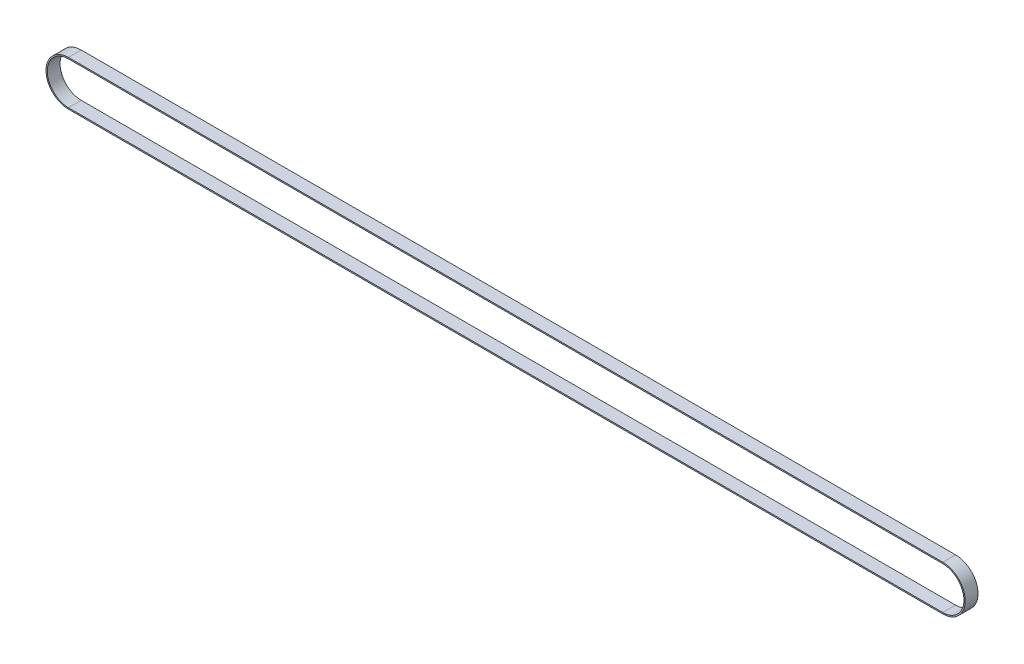
ISO-10303-21;
HEADER;
FILE_DESCRIPTION(('STEP AP214'),'2;1');
FILE_NAME('part.step','',(''),(''),'','','');
FILE_SCHEMA(('AUTOMOTIVE_DESIGN { 1 0 10303 214 1 1 1 1 }'));
ENDSEC;
DATA;
#1=APPLICATION_CONTEXT('core data for automotive mechanical design processes');
#2=APPLICATION_PROTOCOL_DEFINITION('international standard','automotive_design',2000,#1);
#3=PRODUCT_CONTEXT('',#1,'mechanical');
#4=PRODUCT('Part','Part','',(#3));
#5=PRODUCT_RELATED_PRODUCT_CATEGORY('part','',(#4));
#6=PRODUCT_DEFINITION_FORMATION('','',#4);
#7=PRODUCT_DEFINITION_CONTEXT('part definition',#1,'design');
#8=PRODUCT_DEFINITION('design','',#6,#7);
#9=PRODUCT_DEFINITION_SHAPE('','',#8);
#10=(LENGTH_UNIT() NAMED_UNIT(*) SI_UNIT(.MILLI.,.METRE.));
#11=(NAMED_UNIT(*) PLANE_ANGLE_UNIT() SI_UNIT($,.RADIAN.));
#12=(NAMED_UNIT(*) SI_UNIT($,.STERADIAN.) SOLID_ANGLE_UNIT());
#13=UNCERTAINTY_MEASURE_WITH_UNIT(LENGTH_MEASURE(1.E-05),#10,'distance_accuracy_value','');
#14=(GEOMETRIC_REPRESENTATION_CONTEXT(3) GLOBAL_UNCERTAINTY_ASSIGNED_CONTEXT((#13)) GLOBAL_UNIT_ASSIGNED_CONTEXT((#10,
#11,#12)) REPRESENTATION_CONTEXT('',''));
#15=CARTESIAN_POINT('',(0.,0.,0.));
#16=DIRECTION('',(0.,0.,1.));
#17=DIRECTION('',(1.,0.,0.));
#18=AXIS2_PLACEMENT_3D('',#15,#16,#17);
#19=CARTESIAN_POINT('',(0.,0.,20.));
#20=DIRECTION('',(0.,0.,-1.));
#21=DIRECTION('',(-1.,0.,0.));
#22=AXIS2_PLACEMENT_3D('',#19,#20,#21);
#23=CYLINDRICAL_SURFACE('',#22,35.);
#24=CARTESIAN_POINT('',(0.,0.,0.));
#25=DIRECTION('',(0.,0.,1.));
#26=DIRECTION('',(1.,0.,0.));
#27=AXIS2_PLACEMENT_3D('',#24,#25,#26);
#28=CIRCLE('',#27,35.);
#29=CARTESIAN_POINT('',(0.,35.,0.));
#30=VERTEX_POINT('',#29);
#31=CARTESIAN_POINT('',(0.,-35.,0.));
#32=VERTEX_POINT('',#31);
#33=EDGE_CURVE('E153',#30,#32,#28,.T.);
#34=ORIENTED_EDGE('',*,*,#33,.T.);
#35=DIRECTION('',(0.,0.,-1.));
#36=VECTOR('',#35,1.);
#37=CARTESIAN_POINT('',(0.,-35.,20.));
#38=LINE('',#37,#36);
#39=CARTESIAN_POINT('',(0.,-35.,20.));
#40=VERTEX_POINT('',#39);
#41=EDGE_CURVE('E11',#40,#32,#38,.T.);
#42=ORIENTED_EDGE('',*,*,#41,.F.);
#43=CARTESIAN_POINT('',(0.,0.,20.));
#44=DIRECTION('',(0.,0.,1.));
#45=DIRECTION('',(1.,0.,0.));
#46=AXIS2_PLACEMENT_3D('',#43,#44,#45);
#47=CIRCLE('',#46,35.);
#48=CARTESIAN_POINT('',(0.,35.,20.));
#49=VERTEX_POINT('',#48);
#50=EDGE_CURVE('E159',#49,#40,#47,.T.);
#51=ORIENTED_EDGE('',*,*,#50,.F.);
#52=DIRECTION('',(0.,0.,-1.));
#53=VECTOR('',#52,1.);
#54=CARTESIAN_POINT('',(0.,35.,20.));
#55=LINE('',#54,#53);
#56=EDGE_CURVE('E173',#49,#30,#55,.T.);
#57=ORIENTED_EDGE('',*,*,#56,.T.);
#58=EDGE_LOOP('',(#34,#42,#51,#57));
#59=FACE_BOUND('',#58,.T.);
#60=ADVANCED_FACE('F45',(#59),#23,.T.);
#61=CARTESIAN_POINT('',(0.,-35.,20.));
#62=DIRECTION('',(0.,1.,0.));
#63=DIRECTION('',(-1.,0.,0.));
#64=AXIS2_PLACEMENT_3D('',#61,#62,#63);
#65=PLANE('',#64);
#66=DIRECTION('',(1.,0.,0.));
#67=VECTOR('',#66,1.);
#68=CARTESIAN_POINT('',(0.,-35.,0.));
#69=LINE('',#68,#67);
#70=CARTESIAN_POINT('',(1365.,-34.9999999999997,0.));
#71=VERTEX_POINT('',#70);
#72=EDGE_CURVE('E177',#32,#71,#69,.T.);
#73=ORIENTED_EDGE('',*,*,#72,.T.);
#74=DIRECTION('',(0.,0.,-1.));
#75=VECTOR('',#74,1.);
#76=CARTESIAN_POINT('',(1365.,-34.9999999999997,20.));
#77=LINE('',#76,#75);
#78=CARTESIAN_POINT('',(1365.,-34.9999999999997,20.));
#79=VERTEX_POINT('',#78);
#80=EDGE_CURVE('E53',#79,#71,#77,.T.);
#81=ORIENTED_EDGE('',*,*,#80,.F.);
#82=DIRECTION('',(1.,0.,0.));
#83=VECTOR('',#82,1.);
#84=CARTESIAN_POINT('',(0.,-35.,20.));
#85=LINE('',#84,#83);
#86=EDGE_CURVE('E163',#40,#79,#85,.T.);
#87=ORIENTED_EDGE('',*,*,#86,.F.);
#88=ORIENTED_EDGE('',*,*,#41,.T.);
#89=EDGE_LOOP('',(#73,#81,#87,#88));
#90=FACE_BOUND('',#89,.T.);
#91=ADVANCED_FACE('F211',(#90),#65,.F.);
#92=CARTESIAN_POINT('',(1365.,2.50746432125421E-13,20.));
#93=DIRECTION('',(0.,0.,-1.));
#94=DIRECTION('',(-1.,0.,0.));
#95=AXIS2_PLACEMENT_3D('',#92,#93,#94);
#96=CYLINDRICAL_SURFACE('',#95,35.);
#97=CARTESIAN_POINT('',(1365.,2.50746432125421E-13,0.));
#98=DIRECTION('',(0.,0.,1.));
#99=DIRECTION('',(1.,0.,0.));
#100=AXIS2_PLACEMENT_3D('',#97,#98,#99);
#101=CIRCLE('',#100,35.);
#102=CARTESIAN_POINT('',(1365.,35.0000000000002,0.));
#103=VERTEX_POINT('',#102);
#104=EDGE_CURVE('E180',#71,#103,#101,.T.);
#105=ORIENTED_EDGE('',*,*,#104,.T.);
#106=DIRECTION('',(0.,0.,-1.));
#107=VECTOR('',#106,1.);
#108=CARTESIAN_POINT('',(1365.,35.0000000000002,20.));
#109=LINE('',#108,#107);
#110=CARTESIAN_POINT('',(1365.,35.0000000000002,20.));
#111=VERTEX_POINT('',#110);
#112=EDGE_CURVE('E188',#111,#103,#109,.T.);
#113=ORIENTED_EDGE('',*,*,#112,.F.);
#114=CARTESIAN_POINT('',(1365.,2.50746432125421E-13,20.));
#115=DIRECTION('',(0.,0.,1.));
#116=DIRECTION('',(1.,0.,0.));
#117=AXIS2_PLACEMENT_3D('',#114,#115,#116);
#118=CIRCLE('',#117,35.);
#119=EDGE_CURVE('E167',#79,#111,#118,.T.);
#120=ORIENTED_EDGE('',*,*,#119,.F.);
#121=ORIENTED_EDGE('',*,*,#80,.T.);
#122=EDGE_LOOP('',(#105,#113,#120,#121));
#123=FACE_BOUND('',#122,.T.);
#124=ADVANCED_FACE('F197',(#123),#96,.T.);
#125=CARTESIAN_POINT('',(0.,35.,20.));
#126=DIRECTION('',(0.,-1.,0.));
#127=DIRECTION('',(1.,0.,0.));
#128=AXIS2_PLACEMENT_3D('',#125,#126,#127);
#129=PLANE('',#128);
#130=DIRECTION('',(-1.,0.,0.));
#131=VECTOR('',#130,1.);
#132=CARTESIAN_POINT('',(0.,35.,0.));
#133=LINE('',#132,#131);
#134=EDGE_CURVE('E164',#103,#30,#133,.T.);
#135=ORIENTED_EDGE('',*,*,#134,.T.);
#136=ORIENTED_EDGE('',*,*,#56,.F.);
#137=DIRECTION('',(-1.,0.,0.));
#138=VECTOR('',#137,1.);
#139=CARTESIAN_POINT('',(0.,35.,20.));
#140=LINE('',#139,#138);
#141=EDGE_CURVE('E170',#111,#49,#140,.T.);
#142=ORIENTED_EDGE('',*,*,#141,.F.);
#143=ORIENTED_EDGE('',*,*,#112,.T.);
#144=EDGE_LOOP('',(#135,#136,#142,#143));
#145=FACE_BOUND('',#144,.T.);
#146=ADVANCED_FACE('F204',(#145),#129,.F.);
#147=CARTESIAN_POINT('',(0.,0.,20.));
#148=DIRECTION('',(0.,0.,1.));
#149=DIRECTION('',(1.,0.,0.));
#150=AXIS2_PLACEMENT_3D('',#147,#148,#149);
#151=PLANE('',#150);
#152=CARTESIAN_POINT('',(0.,0.,20.));
#153=DIRECTION('',(0.,0.,1.));
#154=DIRECTION('',(1.,0.,0.));
#155=AXIS2_PLACEMENT_3D('',#152,#153,#154);
#156=CIRCLE('',#155,33.);
#157=CARTESIAN_POINT('',(0.,33.,20.));
#158=VERTEX_POINT('',#157);
#159=CARTESIAN_POINT('',(0.,-33.,20.));
#160=VERTEX_POINT('',#159);
#161=EDGE_CURVE('E60',#158,#160,#156,.T.);
#162=ORIENTED_EDGE('',*,*,#161,.F.);
#163=DIRECTION('',(-1.,0.,0.));
#164=VECTOR('',#163,1.);
#165=CARTESIAN_POINT('',(0.,33.,20.));
#166=LINE('',#165,#164);
#167=CARTESIAN_POINT('',(1365.,33.0000000000002,20.));
#168=VERTEX_POINT('',#167);
#169=EDGE_CURVE('E131',#168,#158,#166,.T.);
#170=ORIENTED_EDGE('',*,*,#169,.F.);
#171=CARTESIAN_POINT('',(1365.,2.50746432125421E-13,20.));
#172=DIRECTION('',(0.,0.,1.));
#173=DIRECTION('',(1.,0.,0.));
#174=AXIS2_PLACEMENT_3D('',#171,#172,#173);
#175=CIRCLE('',#174,33.);
#176=CARTESIAN_POINT('',(1365.,-32.9999999999998,20.));
#177=VERTEX_POINT('',#176);
#178=EDGE_CURVE('E135',#177,#168,#175,.T.);
#179=ORIENTED_EDGE('',*,*,#178,.F.);
#180=DIRECTION('',(1.,0.,0.));
#181=VECTOR('',#180,1.);
#182=CARTESIAN_POINT('',(0.,-33.,20.));
#183=LINE('',#182,#181);
#184=EDGE_CURVE('E144',#160,#177,#183,.T.);
#185=ORIENTED_EDGE('',*,*,#184,.F.);
#186=EDGE_LOOP('',(#162,#170,#179,#185));
#187=FACE_BOUND('',#186,.T.);
#188=ORIENTED_EDGE('',*,*,#50,.T.);
#189=ORIENTED_EDGE('',*,*,#86,.T.);
#190=ORIENTED_EDGE('',*,*,#119,.T.);
#191=ORIENTED_EDGE('',*,*,#141,.T.);
#192=EDGE_LOOP('',(#188,#189,#190,#191));
#193=FACE_BOUND('',#192,.T.);
#194=ADVANCED_FACE('F210',(#187,#193),#151,.T.);
#195=CARTESIAN_POINT('',(0.,0.,0.));
#196=DIRECTION('',(0.,0.,1.));
#197=DIRECTION('',(1.,0.,0.));
#198=AXIS2_PLACEMENT_3D('',#195,#196,#197);
#199=PLANE('',#198);
#200=DIRECTION('',(-1.,0.,0.));
#201=VECTOR('',#200,1.);
#202=CARTESIAN_POINT('',(0.,33.,0.));
#203=LINE('',#202,#201);
#204=CARTESIAN_POINT('',(1365.,33.0000000000002,0.));
#205=VERTEX_POINT('',#204);
#206=CARTESIAN_POINT('',(0.,33.,0.));
#207=VERTEX_POINT('',#206);
#208=EDGE_CURVE('E119',#205,#207,#203,.T.);
#209=ORIENTED_EDGE('',*,*,#208,.T.);
#210=CARTESIAN_POINT('',(0.,0.,0.));
#211=DIRECTION('',(0.,0.,1.));
#212=DIRECTION('',(1.,0.,0.));
#213=AXIS2_PLACEMENT_3D('',#210,#211,#212);
#214=CIRCLE('',#213,33.);
#215=CARTESIAN_POINT('',(0.,-33.,0.));
#216=VERTEX_POINT('',#215);
#217=EDGE_CURVE('E112',#207,#216,#214,.T.);
#218=ORIENTED_EDGE('',*,*,#217,.T.);
#219=DIRECTION('',(1.,0.,0.));
#220=VECTOR('',#219,1.);
#221=CARTESIAN_POINT('',(0.,-33.,0.));
#222=LINE('',#221,#220);
#223=CARTESIAN_POINT('',(1365.,-32.9999999999998,0.));
#224=VERTEX_POINT('',#223);
#225=EDGE_CURVE('E122',#216,#224,#222,.T.);
#226=ORIENTED_EDGE('',*,*,#225,.T.);
#227=CARTESIAN_POINT('',(1365.,2.50746432125421E-13,0.));
#228=DIRECTION('',(0.,0.,1.));
#229=DIRECTION('',(1.,0.,0.));
#230=AXIS2_PLACEMENT_3D('',#227,#228,#229);
#231=CIRCLE('',#230,33.);
#232=EDGE_CURVE('E68',#224,#205,#231,.T.);
#233=ORIENTED_EDGE('',*,*,#232,.T.);
#234=EDGE_LOOP('',(#209,#218,#226,#233));
#235=FACE_BOUND('',#234,.T.);
#236=ORIENTED_EDGE('',*,*,#33,.F.);
#237=ORIENTED_EDGE('',*,*,#134,.F.);
#238=ORIENTED_EDGE('',*,*,#104,.F.);
#239=ORIENTED_EDGE('',*,*,#72,.F.);
#240=EDGE_LOOP('',(#236,#237,#238,#239));
#241=FACE_BOUND('',#240,.T.);
#242=ADVANCED_FACE('F127',(#235,#241),#199,.F.);
#243=CARTESIAN_POINT('',(0.,0.,0.));
#244=DIRECTION('',(0.,0.,1.));
#245=DIRECTION('',(1.,0.,0.));
#246=AXIS2_PLACEMENT_3D('',#243,#244,#245);
#247=CYLINDRICAL_SURFACE('',#246,33.);
#248=ORIENTED_EDGE('',*,*,#161,.T.);
#249=DIRECTION('',(0.,0.,1.));
#250=VECTOR('',#249,1.);
#251=CARTESIAN_POINT('',(0.,-33.,0.));
#252=LINE('',#251,#250);
#253=EDGE_CURVE('E108',#216,#160,#252,.T.);
#254=ORIENTED_EDGE('',*,*,#253,.F.);
#255=ORIENTED_EDGE('',*,*,#217,.F.);
#256=DIRECTION('',(0.,0.,1.));
#257=VECTOR('',#256,1.);
#258=CARTESIAN_POINT('',(0.,33.,0.));
#259=LINE('',#258,#257);
#260=EDGE_CURVE('E150',#207,#158,#259,.T.);
#261=ORIENTED_EDGE('',*,*,#260,.T.);
#262=EDGE_LOOP('',(#248,#254,#255,#261));
#263=FACE_BOUND('',#262,.T.);
#264=ADVANCED_FACE('F110',(#263),#247,.F.);
#265=CARTESIAN_POINT('',(0.,33.,0.));
#266=DIRECTION('',(0.,1.,0.));
#267=DIRECTION('',(-1.,0.,0.));
#268=AXIS2_PLACEMENT_3D('',#265,#266,#267);
#269=PLANE('',#268);
#270=ORIENTED_EDGE('',*,*,#169,.T.);
#271=ORIENTED_EDGE('',*,*,#260,.F.);
#272=ORIENTED_EDGE('',*,*,#208,.F.);
#273=DIRECTION('',(0.,0.,1.));
#274=VECTOR('',#273,1.);
#275=CARTESIAN_POINT('',(1365.,33.0000000000002,0.));
#276=LINE('',#275,#274);
#277=EDGE_CURVE('E154',#205,#168,#276,.T.);
#278=ORIENTED_EDGE('',*,*,#277,.T.);
#279=EDGE_LOOP('',(#270,#271,#272,#278));
#280=FACE_BOUND('',#279,.T.);
#281=ADVANCED_FACE('F228',(#280),#269,.F.);
#282=CARTESIAN_POINT('',(1365.,2.50746432125421E-13,0.));
#283=DIRECTION('',(0.,0.,1.));
#284=DIRECTION('',(1.,0.,0.));
#285=AXIS2_PLACEMENT_3D('',#282,#283,#284);
#286=CYLINDRICAL_SURFACE('',#285,33.);
#287=ORIENTED_EDGE('',*,*,#178,.T.);
#288=ORIENTED_EDGE('',*,*,#277,.F.);
#289=ORIENTED_EDGE('',*,*,#232,.F.);
#290=DIRECTION('',(0.,0.,1.));
#291=VECTOR('',#290,1.);
#292=CARTESIAN_POINT('',(1365.,-32.9999999999998,0.));
#293=LINE('',#292,#291);
#294=EDGE_CURVE('E118',#224,#177,#293,.T.);
#295=ORIENTED_EDGE('',*,*,#294,.T.);
#296=EDGE_LOOP('',(#287,#288,#289,#295));
#297=FACE_BOUND('',#296,.T.);
#298=ADVANCED_FACE('F231',(#297),#286,.F.);
#299=CARTESIAN_POINT('',(0.,-33.,0.));
#300=DIRECTION('',(0.,-1.,0.));
#301=DIRECTION('',(1.,0.,0.));
#302=AXIS2_PLACEMENT_3D('',#299,#300,#301);
#303=PLANE('',#302);
#304=ORIENTED_EDGE('',*,*,#184,.T.);
#305=ORIENTED_EDGE('',*,*,#294,.F.);
#306=ORIENTED_EDGE('',*,*,#225,.F.);
#307=ORIENTED_EDGE('',*,*,#253,.T.);
#308=EDGE_LOOP('',(#304,#305,#306,#307));
#309=FACE_BOUND('',#308,.T.);
#310=ADVANCED_FACE('F123',(#309),#303,.F.);
#311=CLOSED_SHELL('',(#60,#91,#124,#146,#194,#242,#264,#281,#298,#310));
#312=MANIFOLD_SOLID_BREP('B2',#311);
#313=ADVANCED_BREP_SHAPE_REPRESENTATION('',(#18,#312),#14);
#314=SHAPE_DEFINITION_REPRESENTATION(#9,#313);
ENDSEC;
END-ISO-10303-21;
